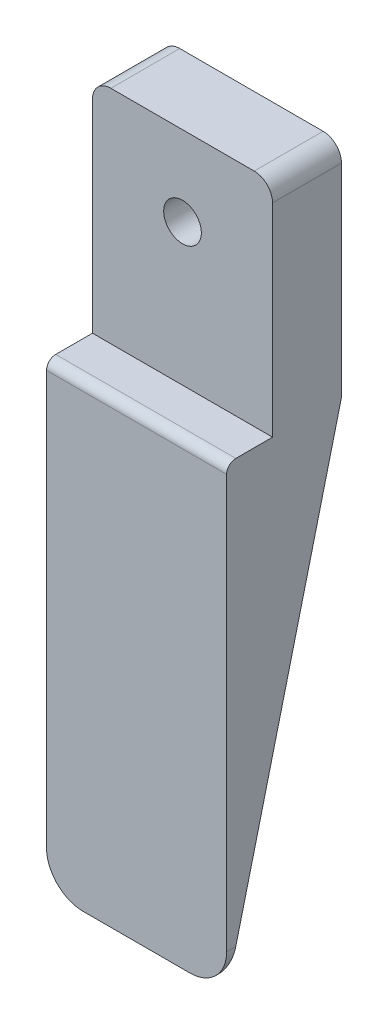
ISO-10303-21;
HEADER;
FILE_DESCRIPTION(('STEP AP214'),'2;1');
FILE_NAME('part.step','',(''),(''),'','','');
FILE_SCHEMA(('AUTOMOTIVE_DESIGN { 1 0 10303 214 1 1 1 1 }'));
ENDSEC;
DATA;
#1=APPLICATION_CONTEXT('core data for automotive mechanical design processes');
#2=APPLICATION_PROTOCOL_DEFINITION('international standard','automotive_design',2000,#1);
#3=PRODUCT_CONTEXT('',#1,'mechanical');
#4=PRODUCT('Part','Part','',(#3));
#5=PRODUCT_RELATED_PRODUCT_CATEGORY('part','',(#4));
#6=PRODUCT_DEFINITION_FORMATION('','',#4);
#7=PRODUCT_DEFINITION_CONTEXT('part definition',#1,'design');
#8=PRODUCT_DEFINITION('design','',#6,#7);
#9=PRODUCT_DEFINITION_SHAPE('','',#8);
#10=(LENGTH_UNIT() NAMED_UNIT(*) SI_UNIT(.MILLI.,.METRE.));
#11=(NAMED_UNIT(*) PLANE_ANGLE_UNIT() SI_UNIT($,.RADIAN.));
#12=(NAMED_UNIT(*) SI_UNIT($,.STERADIAN.) SOLID_ANGLE_UNIT());
#13=UNCERTAINTY_MEASURE_WITH_UNIT(LENGTH_MEASURE(1.E-05),#10,'distance_accuracy_value','');
#14=(GEOMETRIC_REPRESENTATION_CONTEXT(3) GLOBAL_UNCERTAINTY_ASSIGNED_CONTEXT((#13)) GLOBAL_UNIT_ASSIGNED_CONTEXT((#10,
#11,#12)) REPRESENTATION_CONTEXT('',''));
#15=CARTESIAN_POINT('',(0.,0.,0.));
#16=DIRECTION('',(0.,0.,1.));
#17=DIRECTION('',(1.,0.,0.));
#18=AXIS2_PLACEMENT_3D('',#15,#16,#17);
#19=CARTESIAN_POINT('',(0.,-51.7023947392816,0.0010000000000062));
#20=DIRECTION('',(0.,0.,-1.));
#21=DIRECTION('',(-1.,0.,0.));
#22=AXIS2_PLACEMENT_3D('',#19,#20,#21);
#23=CYLINDRICAL_SURFACE('',#22,2.05);
#24=CARTESIAN_POINT('',(0.,-51.7023947392816,-9.50000000000001));
#25=DIRECTION('',(0.,0.,-1.));
#26=DIRECTION('',(-1.,0.,0.));
#27=AXIS2_PLACEMENT_3D('',#24,#25,#26);
#28=CIRCLE('',#27,2.05);
#29=CARTESIAN_POINT('',(-2.05,-51.7023947392816,-9.50000000000001));
#30=VERTEX_POINT('',#29);
#31=EDGE_CURVE('E285',#30,#30,#28,.T.);
#32=ORIENTED_EDGE('',*,*,#31,.T.);
#33=EDGE_LOOP('',(#32));
#34=FACE_BOUND('',#33,.T.);
#35=CARTESIAN_POINT('',(0.,-51.7023947392816,-5.));
#36=DIRECTION('',(0.,0.,1.));
#37=DIRECTION('',(0.,-1.,0.));
#38=AXIS2_PLACEMENT_3D('',#35,#36,#37);
#39=CIRCLE('',#38,2.05);
#40=CARTESIAN_POINT('',(0.,-53.7523947392816,-5.));
#41=VERTEX_POINT('',#40);
#42=EDGE_CURVE('E382',#41,#41,#39,.F.);
#43=ORIENTED_EDGE('',*,*,#42,.F.);
#44=EDGE_LOOP('',(#43));
#45=FACE_BOUND('',#44,.T.);
#46=ADVANCED_FACE('F71',(#34,#45),#23,.F.);
#47=CARTESIAN_POINT('',(-9.80000000000001,0.,-12.5));
#48=DIRECTION('',(-1.,0.,0.));
#49=DIRECTION('',(0.,-1.,0.));
#50=AXIS2_PLACEMENT_3D('',#47,#48,#49);
#51=PLANE('',#50);
#52=DIRECTION('',(0.,-1.,0.));
#53=VECTOR('',#52,1.);
#54=CARTESIAN_POINT('',(-9.80000000000001,0.,0.));
#55=LINE('',#54,#53);
#56=CARTESIAN_POINT('',(-9.8,-68.0809924354783,0.));
#57=VERTEX_POINT('',#56);
#58=CARTESIAN_POINT('',(-9.8,-113.080992435478,0.));
#59=VERTEX_POINT('',#58);
#60=EDGE_CURVE('E217',#57,#59,#55,.T.);
#61=ORIENTED_EDGE('',*,*,#60,.F.);
#62=CARTESIAN_POINT('',(-9.8,-68.0809924354783,-1.));
#63=DIRECTION('',(-1.,0.,0.));
#64=DIRECTION('',(0.,-1.,0.));
#65=AXIS2_PLACEMENT_3D('',#62,#63,#64);
#66=CIRCLE('',#65,1.);
#67=CARTESIAN_POINT('',(-9.8,-67.0809924354783,-1.));
#68=VERTEX_POINT('',#67);
#69=EDGE_CURVE('E279',#57,#68,#66,.T.);
#70=ORIENTED_EDGE('',*,*,#69,.T.);
#71=DIRECTION('',(0.,0.,1.));
#72=VECTOR('',#71,1.);
#73=CARTESIAN_POINT('',(-9.8,-67.0809924354783,0.));
#74=LINE('',#73,#72);
#75=CARTESIAN_POINT('',(-9.8,-67.0809924354783,-5.));
#76=VERTEX_POINT('',#75);
#77=EDGE_CURVE('E180',#76,#68,#74,.T.);
#78=ORIENTED_EDGE('',*,*,#77,.F.);
#79=DIRECTION('',(0.,-1.,0.));
#80=VECTOR('',#79,1.);
#81=CARTESIAN_POINT('',(-9.80000000000001,0.,-4.99999999999999));
#82=LINE('',#81,#80);
#83=CARTESIAN_POINT('',(-9.80000000000001,-45.,-5.));
#84=VERTEX_POINT('',#83);
#85=EDGE_CURVE('E212',#84,#76,#82,.T.);
#86=ORIENTED_EDGE('',*,*,#85,.F.);
#87=DIRECTION('',(0.,0.,1.));
#88=VECTOR('',#87,1.);
#89=CARTESIAN_POINT('',(-9.80000000000001,-45.,-12.5));
#90=LINE('',#89,#88);
#91=CARTESIAN_POINT('',(-9.80000000000001,-45.,-12.5));
#92=VERTEX_POINT('',#91);
#93=EDGE_CURVE('E165',#84,#92,#90,.F.);
#94=ORIENTED_EDGE('',*,*,#93,.T.);
#95=DIRECTION('',(0.,-1.,0.));
#96=VECTOR('',#95,1.);
#97=CARTESIAN_POINT('',(-9.80000000000001,0.,-12.5));
#98=LINE('',#97,#96);
#99=CARTESIAN_POINT('',(-9.8,-67.0809924354783,-12.5));
#100=VERTEX_POINT('',#99);
#101=EDGE_CURVE('E157',#92,#100,#98,.T.);
#102=ORIENTED_EDGE('',*,*,#101,.T.);
#103=DIRECTION('',(0.,-0.970142500145332,0.242535625036333));
#104=VECTOR('',#103,1.);
#105=CARTESIAN_POINT('',(-9.80000000000001,-6.88711720208696,-27.5484688083478));
#106=LINE('',#105,#104);
#107=CARTESIAN_POINT('',(-9.8,-113.080992435478,-1.00000000000001));
#108=VERTEX_POINT('',#107);
#109=EDGE_CURVE('E161',#100,#108,#106,.T.);
#110=ORIENTED_EDGE('',*,*,#109,.T.);
#111=DIRECTION('',(0.,0.,1.));
#112=VECTOR('',#111,1.);
#113=CARTESIAN_POINT('',(-9.8,-113.080992435478,-12.5));
#114=LINE('',#113,#112);
#115=EDGE_CURVE('E225',#108,#59,#114,.T.);
#116=ORIENTED_EDGE('',*,*,#115,.T.);
#117=EDGE_LOOP('',(#61,#70,#78,#86,#94,#102,#110,#116));
#118=FACE_BOUND('',#117,.T.);
#119=ADVANCED_FACE('F159',(#118),#51,.T.);
#120=CARTESIAN_POINT('',(0.,-43.,-12.5));
#121=DIRECTION('',(0.,1.,0.));
#122=DIRECTION('',(0.,0.,1.));
#123=AXIS2_PLACEMENT_3D('',#120,#121,#122);
#124=PLANE('',#123);
#125=DIRECTION('',(1.,0.,0.));
#126=VECTOR('',#125,1.);
#127=CARTESIAN_POINT('',(-9.80100000000003,-43.,-5.));
#128=LINE('',#127,#126);
#129=CARTESIAN_POINT('',(-7.80000000000001,-43.,-5.));
#130=VERTEX_POINT('',#129);
#131=CARTESIAN_POINT('',(7.79999999999998,-43.,-5.));
#132=VERTEX_POINT('',#131);
#133=EDGE_CURVE('E208',#130,#132,#128,.T.);
#134=ORIENTED_EDGE('',*,*,#133,.T.);
#135=DIRECTION('',(0.,0.,1.));
#136=VECTOR('',#135,1.);
#137=CARTESIAN_POINT('',(7.79999999999999,-43.,-12.5));
#138=LINE('',#137,#136);
#139=CARTESIAN_POINT('',(7.79999999999999,-43.,-12.5));
#140=VERTEX_POINT('',#139);
#141=EDGE_CURVE('E260',#132,#140,#138,.F.);
#142=ORIENTED_EDGE('',*,*,#141,.T.);
#143=DIRECTION('',(-1.,0.,0.));
#144=VECTOR('',#143,1.);
#145=CARTESIAN_POINT('',(0.,-43.,-12.5));
#146=LINE('',#145,#144);
#147=CARTESIAN_POINT('',(-7.80000000000001,-43.,-12.5));
#148=VERTEX_POINT('',#147);
#149=EDGE_CURVE('E221',#140,#148,#146,.T.);
#150=ORIENTED_EDGE('',*,*,#149,.T.);
#151=DIRECTION('',(0.,0.,1.));
#152=VECTOR('',#151,1.);
#153=CARTESIAN_POINT('',(-7.80000000000001,-43.,-12.5));
#154=LINE('',#153,#152);
#155=EDGE_CURVE('E256',#148,#130,#154,.T.);
#156=ORIENTED_EDGE('',*,*,#155,.T.);
#157=EDGE_LOOP('',(#134,#142,#150,#156));
#158=FACE_BOUND('',#157,.T.);
#159=ADVANCED_FACE('F309',(#158),#124,.T.);
#160=CARTESIAN_POINT('',(9.79999999999998,0.,-12.5));
#161=DIRECTION('',(1.,0.,0.));
#162=DIRECTION('',(0.,1.,0.));
#163=AXIS2_PLACEMENT_3D('',#160,#161,#162);
#164=PLANE('',#163);
#165=DIRECTION('',(0.,0.,1.));
#166=VECTOR('',#165,1.);
#167=CARTESIAN_POINT('',(9.79999999999999,-67.0809924354783,0.));
#168=LINE('',#167,#166);
#169=CARTESIAN_POINT('',(9.79999999999999,-67.0809924354783,-5.));
#170=VERTEX_POINT('',#169);
#171=CARTESIAN_POINT('',(9.79999999999999,-67.0809924354783,-1.));
#172=VERTEX_POINT('',#171);
#173=EDGE_CURVE('E201',#170,#172,#168,.T.);
#174=ORIENTED_EDGE('',*,*,#173,.T.);
#175=CARTESIAN_POINT('',(9.79999999999999,-68.0809924354783,-1.));
#176=DIRECTION('',(1.,0.,0.));
#177=DIRECTION('',(0.,1.,0.));
#178=AXIS2_PLACEMENT_3D('',#175,#176,#177);
#179=CIRCLE('',#178,1.);
#180=CARTESIAN_POINT('',(9.79999999999999,-68.0809924354783,0.));
#181=VERTEX_POINT('',#180);
#182=EDGE_CURVE('E96',#172,#181,#179,.T.);
#183=ORIENTED_EDGE('',*,*,#182,.T.);
#184=DIRECTION('',(0.,1.,0.));
#185=VECTOR('',#184,1.);
#186=CARTESIAN_POINT('',(9.79999999999998,0.,0.));
#187=LINE('',#186,#185);
#188=CARTESIAN_POINT('',(9.8,-113.080992435478,0.));
#189=VERTEX_POINT('',#188);
#190=EDGE_CURVE('E171',#189,#181,#187,.T.);
#191=ORIENTED_EDGE('',*,*,#190,.F.);
#192=DIRECTION('',(0.,0.,1.));
#193=VECTOR('',#192,1.);
#194=CARTESIAN_POINT('',(9.8,-113.080992435478,-12.5));
#195=LINE('',#194,#193);
#196=CARTESIAN_POINT('',(9.8,-113.080992435478,-0.999999999999994));
#197=VERTEX_POINT('',#196);
#198=EDGE_CURVE('E241',#197,#189,#195,.T.);
#199=ORIENTED_EDGE('',*,*,#198,.F.);
#200=DIRECTION('',(0.,-0.970142500145332,0.242535625036333));
#201=VECTOR('',#200,1.);
#202=CARTESIAN_POINT('',(9.79999999999998,-6.88711720208696,-27.5484688083478));
#203=LINE('',#202,#201);
#204=CARTESIAN_POINT('',(9.79999999999999,-67.0809924354783,-12.5));
#205=VERTEX_POINT('',#204);
#206=EDGE_CURVE('E187',#205,#197,#203,.T.);
#207=ORIENTED_EDGE('',*,*,#206,.F.);
#208=DIRECTION('',(0.,1.,0.));
#209=VECTOR('',#208,1.);
#210=CARTESIAN_POINT('',(9.79999999999998,0.,-12.5));
#211=LINE('',#210,#209);
#212=CARTESIAN_POINT('',(9.79999999999999,-45.,-12.5));
#213=VERTEX_POINT('',#212);
#214=EDGE_CURVE('E170',#205,#213,#211,.T.);
#215=ORIENTED_EDGE('',*,*,#214,.T.);
#216=DIRECTION('',(0.,0.,1.));
#217=VECTOR('',#216,1.);
#218=CARTESIAN_POINT('',(9.79999999999999,-45.,-12.5));
#219=LINE('',#218,#217);
#220=CARTESIAN_POINT('',(9.79999999999999,-45.,-5.));
#221=VERTEX_POINT('',#220);
#222=EDGE_CURVE('E244',#213,#221,#219,.T.);
#223=ORIENTED_EDGE('',*,*,#222,.T.);
#224=DIRECTION('',(0.,-1.,0.));
#225=VECTOR('',#224,1.);
#226=CARTESIAN_POINT('',(9.79999999999998,0.,-4.99999999999999));
#227=LINE('',#226,#225);
#228=EDGE_CURVE('E204',#221,#170,#227,.T.);
#229=ORIENTED_EDGE('',*,*,#228,.T.);
#230=EDGE_LOOP('',(#174,#183,#191,#199,#207,#215,#223,#229));
#231=FACE_BOUND('',#230,.T.);
#232=ADVANCED_FACE('F334',(#231),#164,.T.);
#233=CARTESIAN_POINT('',(0.,0.,0.));
#234=DIRECTION('',(0.,0.,1.));
#235=DIRECTION('',(1.,0.,0.));
#236=AXIS2_PLACEMENT_3D('',#233,#234,#235);
#237=PLANE('',#236);
#238=ORIENTED_EDGE('',*,*,#190,.T.);
#239=DIRECTION('',(1.,0.,0.));
#240=VECTOR('',#239,1.);
#241=CARTESIAN_POINT('',(0.,-68.0809924354783,0.));
#242=LINE('',#241,#240);
#243=EDGE_CURVE('E88',#181,#57,#242,.F.);
#244=ORIENTED_EDGE('',*,*,#243,.T.);
#245=ORIENTED_EDGE('',*,*,#60,.T.);
#246=CARTESIAN_POINT('',(-5.8,-113.080992435478,0.));
#247=DIRECTION('',(0.,0.,1.));
#248=DIRECTION('',(1.,0.,0.));
#249=AXIS2_PLACEMENT_3D('',#246,#247,#248);
#250=CIRCLE('',#249,4.);
#251=CARTESIAN_POINT('',(-5.8,-117.080992435478,0.));
#252=VERTEX_POINT('',#251);
#253=EDGE_CURVE('E228',#59,#252,#250,.T.);
#254=ORIENTED_EDGE('',*,*,#253,.T.);
#255=DIRECTION('',(1.,0.,0.));
#256=VECTOR('',#255,1.);
#257=CARTESIAN_POINT('',(0.,-117.080992435478,0.));
#258=LINE('',#257,#256);
#259=CARTESIAN_POINT('',(5.79999999999997,-117.080992435478,0.));
#260=VERTEX_POINT('',#259);
#261=EDGE_CURVE('E232',#252,#260,#258,.T.);
#262=ORIENTED_EDGE('',*,*,#261,.T.);
#263=CARTESIAN_POINT('',(5.8,-113.080992435478,0.));
#264=DIRECTION('',(0.,0.,1.));
#265=DIRECTION('',(1.,0.,0.));
#266=AXIS2_PLACEMENT_3D('',#263,#264,#265);
#267=CIRCLE('',#266,4.);
#268=EDGE_CURVE('E236',#260,#189,#267,.T.);
#269=ORIENTED_EDGE('',*,*,#268,.T.);
#270=EDGE_LOOP('',(#238,#244,#245,#254,#262,#269));
#271=FACE_BOUND('',#270,.T.);
#272=ADVANCED_FACE('F330',(#271),#237,.T.);
#273=CARTESIAN_POINT('',(5.8,-113.080992435478,-12.5));
#274=DIRECTION('',(0.,0.,1.));
#275=DIRECTION('',(1.,0.,0.));
#276=AXIS2_PLACEMENT_3D('',#273,#274,#275);
#277=CYLINDRICAL_SURFACE('',#276,4.);
#278=CARTESIAN_POINT('',(5.8,-113.080992435478,-1.));
#279=DIRECTION('',(0.,0.242535625036333,0.970142500145332));
#280=DIRECTION('',(0.,-0.970142500145332,0.242535625036333));
#281=AXIS2_PLACEMENT_3D('',#278,#279,#280);
#282=ELLIPSE('',#281,4.12310562561766,4.);
#283=EDGE_CURVE('E194',#260,#197,#282,.T.);
#284=ORIENTED_EDGE('',*,*,#283,.T.);
#285=ORIENTED_EDGE('',*,*,#198,.T.);
#286=ORIENTED_EDGE('',*,*,#268,.F.);
#287=EDGE_LOOP('',(#284,#285,#286));
#288=FACE_BOUND('',#287,.T.);
#289=ADVANCED_FACE('F333',(#288),#277,.T.);
#290=CARTESIAN_POINT('',(-5.8,-113.080992435478,-12.5));
#291=DIRECTION('',(0.,0.,1.));
#292=DIRECTION('',(1.,0.,0.));
#293=AXIS2_PLACEMENT_3D('',#290,#291,#292);
#294=CYLINDRICAL_SURFACE('',#293,4.);
#295=CARTESIAN_POINT('',(-5.8,-113.080992435478,-1.));
#296=DIRECTION('',(0.,0.242535625036333,0.970142500145332));
#297=DIRECTION('',(0.,-0.970142500145332,0.242535625036333));
#298=AXIS2_PLACEMENT_3D('',#295,#296,#297);
#299=ELLIPSE('',#298,4.12310562561766,4.);
#300=EDGE_CURVE('E178',#108,#252,#299,.T.);
#301=ORIENTED_EDGE('',*,*,#300,.T.);
#302=ORIENTED_EDGE('',*,*,#253,.F.);
#303=ORIENTED_EDGE('',*,*,#115,.F.);
#304=EDGE_LOOP('',(#301,#302,#303));
#305=FACE_BOUND('',#304,.T.);
#306=ADVANCED_FACE('F328',(#305),#294,.T.);
#307=CARTESIAN_POINT('',(0.,0.,-12.5));
#308=DIRECTION('',(0.,0.,1.));
#309=DIRECTION('',(1.,0.,0.));
#310=AXIS2_PLACEMENT_3D('',#307,#308,#309);
#311=PLANE('',#310);
#312=CARTESIAN_POINT('',(0.,-51.7023947392816,-12.5));
#313=DIRECTION('',(0.,0.,1.));
#314=DIRECTION('',(1.,0.,0.));
#315=AXIS2_PLACEMENT_3D('',#312,#313,#314);
#316=CIRCLE('',#315,4.64999999999997);
#317=CARTESIAN_POINT('',(4.64999999999997,-51.7023947392816,-12.5));
#318=VERTEX_POINT('',#317);
#319=EDGE_CURVE('E12',#318,#318,#316,.T.);
#320=ORIENTED_EDGE('',*,*,#319,.T.);
#321=EDGE_LOOP('',(#320));
#322=FACE_BOUND('',#321,.T.);
#323=ORIENTED_EDGE('',*,*,#149,.F.);
#324=CARTESIAN_POINT('',(7.79999999999999,-45.,-12.5));
#325=DIRECTION('',(0.,0.,1.));
#326=DIRECTION('',(1.,0.,0.));
#327=AXIS2_PLACEMENT_3D('',#324,#325,#326);
#328=CIRCLE('',#327,2.);
#329=EDGE_CURVE('E266',#140,#213,#328,.F.);
#330=ORIENTED_EDGE('',*,*,#329,.T.);
#331=ORIENTED_EDGE('',*,*,#214,.F.);
#332=DIRECTION('',(1.,0.,0.));
#333=VECTOR('',#332,1.);
#334=CARTESIAN_POINT('',(-9.80100000000002,-67.0809924354783,-12.5));
#335=LINE('',#334,#333);
#336=EDGE_CURVE('E175',#100,#205,#335,.T.);
#337=ORIENTED_EDGE('',*,*,#336,.F.);
#338=ORIENTED_EDGE('',*,*,#101,.F.);
#339=CARTESIAN_POINT('',(-7.80000000000001,-45.,-12.5));
#340=DIRECTION('',(0.,0.,1.));
#341=DIRECTION('',(1.,0.,0.));
#342=AXIS2_PLACEMENT_3D('',#339,#340,#341);
#343=CIRCLE('',#342,2.);
#344=EDGE_CURVE('E263',#92,#148,#343,.F.);
#345=ORIENTED_EDGE('',*,*,#344,.T.);
#346=EDGE_LOOP('',(#323,#330,#331,#337,#338,#345));
#347=FACE_BOUND('',#346,.T.);
#348=ADVANCED_FACE('F184',(#322,#347),#311,.F.);
#349=CARTESIAN_POINT('',(-9.80100000000002,-67.0809924354783,0.));
#350=DIRECTION('',(0.,1.,0.));
#351=DIRECTION('',(-1.,0.,0.));
#352=AXIS2_PLACEMENT_3D('',#349,#350,#351);
#353=PLANE('',#352);
#354=ORIENTED_EDGE('',*,*,#77,.T.);
#355=DIRECTION('',(1.,0.,0.));
#356=VECTOR('',#355,1.);
#357=CARTESIAN_POINT('',(-9.80100000000002,-67.0809924354783,-1.));
#358=LINE('',#357,#356);
#359=EDGE_CURVE('E271',#68,#172,#358,.T.);
#360=ORIENTED_EDGE('',*,*,#359,.T.);
#361=ORIENTED_EDGE('',*,*,#173,.F.);
#362=DIRECTION('',(1.,0.,0.));
#363=VECTOR('',#362,1.);
#364=CARTESIAN_POINT('',(-9.80100000000002,-67.0809924354783,-5.));
#365=LINE('',#364,#363);
#366=EDGE_CURVE('E207',#76,#170,#365,.T.);
#367=ORIENTED_EDGE('',*,*,#366,.F.);
#368=EDGE_LOOP('',(#354,#360,#361,#367));
#369=FACE_BOUND('',#368,.T.);
#370=ADVANCED_FACE('F321',(#369),#353,.T.);
#371=CARTESIAN_POINT('',(-9.80100000000003,0.,-4.99999999999999));
#372=DIRECTION('',(0.,0.,1.));
#373=DIRECTION('',(0.,-1.,0.));
#374=AXIS2_PLACEMENT_3D('',#371,#372,#373);
#375=PLANE('',#374);
#376=ORIENTED_EDGE('',*,*,#42,.T.);
#377=EDGE_LOOP('',(#376));
#378=FACE_BOUND('',#377,.T.);
#379=ORIENTED_EDGE('',*,*,#228,.F.);
#380=CARTESIAN_POINT('',(7.79999999999999,-45.,-5.));
#381=DIRECTION('',(0.,0.,1.));
#382=DIRECTION('',(0.,-1.,0.));
#383=AXIS2_PLACEMENT_3D('',#380,#381,#382);
#384=CIRCLE('',#383,2.);
#385=EDGE_CURVE('E253',#221,#132,#384,.T.);
#386=ORIENTED_EDGE('',*,*,#385,.T.);
#387=ORIENTED_EDGE('',*,*,#133,.F.);
#388=CARTESIAN_POINT('',(-7.80000000000001,-45.,-5.));
#389=DIRECTION('',(0.,0.,1.));
#390=DIRECTION('',(0.,-1.,0.));
#391=AXIS2_PLACEMENT_3D('',#388,#389,#390);
#392=CIRCLE('',#391,2.);
#393=EDGE_CURVE('E250',#130,#84,#392,.T.);
#394=ORIENTED_EDGE('',*,*,#393,.T.);
#395=ORIENTED_EDGE('',*,*,#85,.T.);
#396=ORIENTED_EDGE('',*,*,#366,.T.);
#397=EDGE_LOOP('',(#379,#386,#387,#394,#395,#396));
#398=FACE_BOUND('',#397,.T.);
#399=ADVANCED_FACE('F318',(#378,#398),#375,.T.);
#400=CARTESIAN_POINT('',(-9.80100000000003,-6.88711720208696,-27.5484688083478));
#401=DIRECTION('',(0.,0.242535625036333,0.970142500145332));
#402=DIRECTION('',(0.,-0.970142500145332,0.242535625036333));
#403=AXIS2_PLACEMENT_3D('',#400,#401,#402);
#404=PLANE('',#403);
#405=ORIENTED_EDGE('',*,*,#261,.F.);
#406=ORIENTED_EDGE('',*,*,#300,.F.);
#407=ORIENTED_EDGE('',*,*,#109,.F.);
#408=ORIENTED_EDGE('',*,*,#336,.T.);
#409=ORIENTED_EDGE('',*,*,#206,.T.);
#410=ORIENTED_EDGE('',*,*,#283,.F.);
#411=EDGE_LOOP('',(#405,#406,#407,#408,#409,#410));
#412=FACE_BOUND('',#411,.T.);
#413=ADVANCED_FACE('F174',(#412),#404,.F.);
#414=CARTESIAN_POINT('',(7.79999999999999,-45.,-12.5));
#415=DIRECTION('',(0.,0.,1.));
#416=DIRECTION('',(1.,0.,0.));
#417=AXIS2_PLACEMENT_3D('',#414,#415,#416);
#418=CYLINDRICAL_SURFACE('',#417,2.);
#419=ORIENTED_EDGE('',*,*,#329,.F.);
#420=ORIENTED_EDGE('',*,*,#141,.F.);
#421=ORIENTED_EDGE('',*,*,#385,.F.);
#422=ORIENTED_EDGE('',*,*,#222,.F.);
#423=EDGE_LOOP('',(#419,#420,#421,#422));
#424=FACE_BOUND('',#423,.T.);
#425=ADVANCED_FACE('F317',(#424),#418,.T.);
#426=CARTESIAN_POINT('',(-7.80000000000001,-45.,-12.5));
#427=DIRECTION('',(0.,0.,1.));
#428=DIRECTION('',(1.,0.,0.));
#429=AXIS2_PLACEMENT_3D('',#426,#427,#428);
#430=CYLINDRICAL_SURFACE('',#429,2.);
#431=ORIENTED_EDGE('',*,*,#344,.F.);
#432=ORIENTED_EDGE('',*,*,#93,.F.);
#433=ORIENTED_EDGE('',*,*,#393,.F.);
#434=ORIENTED_EDGE('',*,*,#155,.F.);
#435=EDGE_LOOP('',(#431,#432,#433,#434));
#436=FACE_BOUND('',#435,.T.);
#437=ADVANCED_FACE('F348',(#436),#430,.T.);
#438=CARTESIAN_POINT('',(-9.80100000000002,-68.0809924354783,-1.));
#439=DIRECTION('',(1.,0.,0.));
#440=DIRECTION('',(0.,1.,0.));
#441=AXIS2_PLACEMENT_3D('',#438,#439,#440);
#442=CYLINDRICAL_SURFACE('',#441,1.);
#443=ORIENTED_EDGE('',*,*,#69,.F.);
#444=ORIENTED_EDGE('',*,*,#243,.F.);
#445=ORIENTED_EDGE('',*,*,#182,.F.);
#446=ORIENTED_EDGE('',*,*,#359,.F.);
#447=EDGE_LOOP('',(#443,#444,#445,#446));
#448=FACE_BOUND('',#447,.T.);
#449=ADVANCED_FACE('F352',(#448),#442,.T.);
#450=CARTESIAN_POINT('',(0.,-51.7023947392816,-10.));
#451=DIRECTION('',(0.,0.,-1.));
#452=DIRECTION('',(-1.,0.,0.));
#453=AXIS2_PLACEMENT_3D('',#450,#451,#452);
#454=PLANE('',#453);
#455=CARTESIAN_POINT('',(0.,-51.7023947392816,-10.));
#456=DIRECTION('',(0.,0.,-1.));
#457=DIRECTION('',(-1.,0.,0.));
#458=AXIS2_PLACEMENT_3D('',#455,#456,#457);
#459=CIRCLE('',#458,2.54999999999999);
#460=CARTESIAN_POINT('',(-2.54999999999999,-51.7023947392816,-10.));
#461=VERTEX_POINT('',#460);
#462=EDGE_CURVE('E282',#461,#461,#459,.F.);
#463=ORIENTED_EDGE('',*,*,#462,.T.);
#464=EDGE_LOOP('',(#463));
#465=FACE_BOUND('',#464,.T.);
#466=CARTESIAN_POINT('',(0.,-51.7023947392816,-10.));
#467=DIRECTION('',(0.,0.,-1.));
#468=DIRECTION('',(-1.,0.,0.));
#469=AXIS2_PLACEMENT_3D('',#466,#467,#468);
#470=CIRCLE('',#469,4.15);
#471=CARTESIAN_POINT('',(-4.15,-51.7023947392816,-10.));
#472=VERTEX_POINT('',#471);
#473=EDGE_CURVE('E385',#472,#472,#470,.T.);
#474=ORIENTED_EDGE('',*,*,#473,.T.);
#475=EDGE_LOOP('',(#474));
#476=FACE_BOUND('',#475,.T.);
#477=ADVANCED_FACE('F355',(#465,#476),#454,.T.);
#478=CARTESIAN_POINT('',(0.,-51.7023947392816,-10.));
#479=DIRECTION('',(0.,0.,-1.));
#480=DIRECTION('',(-1.,0.,0.));
#481=AXIS2_PLACEMENT_3D('',#478,#479,#480);
#482=CYLINDRICAL_SURFACE('',#481,4.15);
#483=CARTESIAN_POINT('',(0.,-51.7023947392816,-12.));
#484=DIRECTION('',(0.,0.,1.));
#485=DIRECTION('',(1.,0.,0.));
#486=AXIS2_PLACEMENT_3D('',#483,#484,#485);
#487=CIRCLE('',#486,4.15);
#488=CARTESIAN_POINT('',(4.15,-51.7023947392816,-12.));
#489=VERTEX_POINT('',#488);
#490=EDGE_CURVE('E81',#489,#489,#487,.F.);
#491=ORIENTED_EDGE('',*,*,#490,.T.);
#492=EDGE_LOOP('',(#491));
#493=FACE_BOUND('',#492,.T.);
#494=ORIENTED_EDGE('',*,*,#473,.F.);
#495=EDGE_LOOP('',(#494));
#496=FACE_BOUND('',#495,.T.);
#497=ADVANCED_FACE('F292',(#493,#496),#482,.F.);
#498=CARTESIAN_POINT('',(0.,-51.7023947392816,-10.));
#499=DIRECTION('',(0.,0.,-1.));
#500=DIRECTION('',(-1.,0.,0.));
#501=AXIS2_PLACEMENT_3D('',#498,#499,#500);
#502=CONICAL_SURFACE('',#501,2.54999999999999,0.785398163397447);
#503=ORIENTED_EDGE('',*,*,#31,.F.);
#504=EDGE_LOOP('',(#503));
#505=FACE_BOUND('',#504,.T.);
#506=ORIENTED_EDGE('',*,*,#462,.F.);
#507=EDGE_LOOP('',(#506));
#508=FACE_BOUND('',#507,.T.);
#509=ADVANCED_FACE('F296',(#505,#508),#502,.F.);
#510=CARTESIAN_POINT('',(0.,-51.7023947392816,-12.));
#511=DIRECTION('',(0.,0.,-1.));
#512=DIRECTION('',(-1.,0.,0.));
#513=AXIS2_PLACEMENT_3D('',#510,#511,#512);
#514=CONICAL_SURFACE('',#513,4.15,0.785398163397447);
#515=ORIENTED_EDGE('',*,*,#319,.F.);
#516=EDGE_LOOP('',(#515));
#517=FACE_BOUND('',#516,.T.);
#518=ORIENTED_EDGE('',*,*,#490,.F.);
#519=EDGE_LOOP('',(#518));
#520=FACE_BOUND('',#519,.T.);
#521=ADVANCED_FACE('F74',(#517,#520),#514,.F.);
#522=CLOSED_SHELL('',(#46,#119,#159,#232,#272,#289,#306,#348,#370,#399,#413,#425,#437,#449,#477,
#497,#509,#521));
#523=MANIFOLD_SOLID_BREP('B2',#522);
#524=ADVANCED_BREP_SHAPE_REPRESENTATION('',(#18,#523),#14);
#525=SHAPE_DEFINITION_REPRESENTATION(#9,#524);
ENDSEC;
END-ISO-10303-21;
